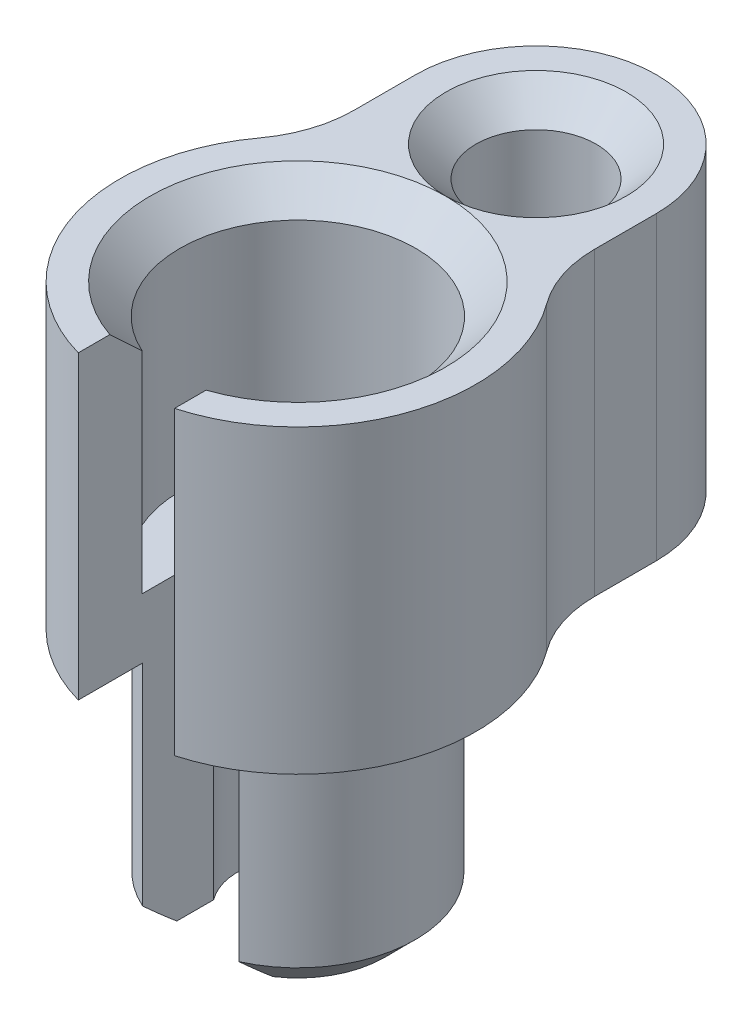
ISO-10303-21;
HEADER;
FILE_DESCRIPTION(('STEP AP214'),'2;1');
FILE_NAME('part.step','',(''),(''),'','','');
FILE_SCHEMA(('AUTOMOTIVE_DESIGN { 1 0 10303 214 1 1 1 1 }'));
ENDSEC;
DATA;
#1=APPLICATION_CONTEXT('core data for automotive mechanical design processes');
#2=APPLICATION_PROTOCOL_DEFINITION('international standard','automotive_design',2000,#1);
#3=PRODUCT_CONTEXT('',#1,'mechanical');
#4=PRODUCT('Part','Part','',(#3));
#5=PRODUCT_RELATED_PRODUCT_CATEGORY('part','',(#4));
#6=PRODUCT_DEFINITION_FORMATION('','',#4);
#7=PRODUCT_DEFINITION_CONTEXT('part definition',#1,'design');
#8=PRODUCT_DEFINITION('design','',#6,#7);
#9=PRODUCT_DEFINITION_SHAPE('','',#8);
#10=(LENGTH_UNIT() NAMED_UNIT(*) SI_UNIT(.MILLI.,.METRE.));
#11=(NAMED_UNIT(*) PLANE_ANGLE_UNIT() SI_UNIT($,.RADIAN.));
#12=(NAMED_UNIT(*) SI_UNIT($,.STERADIAN.) SOLID_ANGLE_UNIT());
#13=UNCERTAINTY_MEASURE_WITH_UNIT(LENGTH_MEASURE(1.E-05),#10,'distance_accuracy_value','');
#14=(GEOMETRIC_REPRESENTATION_CONTEXT(3) GLOBAL_UNCERTAINTY_ASSIGNED_CONTEXT((#13)) GLOBAL_UNIT_ASSIGNED_CONTEXT((#10,
#11,#12)) REPRESENTATION_CONTEXT('',''));
#15=CARTESIAN_POINT('',(0.,0.,0.));
#16=DIRECTION('',(0.,0.,1.));
#17=DIRECTION('',(1.,0.,0.));
#18=AXIS2_PLACEMENT_3D('',#15,#16,#17);
#19=CARTESIAN_POINT('',(0.,0.120875177305015,0.));
#20=DIRECTION('',(0.,1.,0.));
#21=DIRECTION('',(-1.,0.,0.));
#22=AXIS2_PLACEMENT_3D('',#19,#20,#21);
#23=CYLINDRICAL_SURFACE('',#22,4.69900000000067);
#24=CARTESIAN_POINT('',(0.,14.2875,0.));
#25=DIRECTION('',(0.,1.,0.));
#26=DIRECTION('',(-1.,0.,0.));
#27=AXIS2_PLACEMENT_3D('',#24,#25,#26);
#28=CIRCLE('',#27,4.699);
#29=CARTESIAN_POINT('',(-3.78951612903194,14.2875,-2.77851912136785));
#30=VERTEX_POINT('',#29);
#31=CARTESIAN_POINT('',(-1.27,14.2875,4.52412433516144));
#32=VERTEX_POINT('',#31);
#33=EDGE_CURVE('E362',#30,#32,#28,.T.);
#34=ORIENTED_EDGE('',*,*,#33,.F.);
#35=DIRECTION('',(0.,1.,0.));
#36=VECTOR('',#35,1.);
#37=CARTESIAN_POINT('',(-3.78951612903247,0.120875177305014,-2.77851912136825));
#38=LINE('',#37,#36);
#39=CARTESIAN_POINT('',(-3.78951612903301,6.35,-2.77851912136864));
#40=VERTEX_POINT('',#39);
#41=EDGE_CURVE('E364',#30,#40,#38,.F.);
#42=ORIENTED_EDGE('',*,*,#41,.T.);
#43=CARTESIAN_POINT('',(0.,6.35,0.));
#44=DIRECTION('',(0.,1.,0.));
#45=DIRECTION('',(-1.,0.,0.));
#46=AXIS2_PLACEMENT_3D('',#43,#44,#45);
#47=CIRCLE('',#46,4.69900000000133);
#48=CARTESIAN_POINT('',(-1.27,6.35,4.52412433516214));
#49=VERTEX_POINT('',#48);
#50=EDGE_CURVE('E430',#40,#49,#47,.T.);
#51=ORIENTED_EDGE('',*,*,#50,.T.);
#52=DIRECTION('',(0.,1.,0.));
#53=VECTOR('',#52,1.);
#54=CARTESIAN_POINT('',(-1.27,0.120875177305015,4.52412433516214));
#55=LINE('',#54,#53);
#56=EDGE_CURVE('E185',#49,#32,#55,.T.);
#57=ORIENTED_EDGE('',*,*,#56,.T.);
#58=EDGE_LOOP('',(#34,#42,#51,#57));
#59=FACE_BOUND('',#58,.T.);
#60=ADVANCED_FACE('F47',(#59),#23,.T.);
#61=CARTESIAN_POINT('',(0.,0.120875177305015,0.));
#62=DIRECTION('',(0.,1.,0.));
#63=DIRECTION('',(-1.,0.,0.));
#64=AXIS2_PLACEMENT_3D('',#61,#62,#63);
#65=CYLINDRICAL_SURFACE('',#64,3.1115);
#66=DIRECTION('',(0.,1.,0.));
#67=VECTOR('',#66,1.);
#68=CARTESIAN_POINT('',(1.27,0.120875177305015,2.84051619428582));
#69=LINE('',#68,#67);
#70=CARTESIAN_POINT('',(1.27,7.9375,2.84051619428582));
#71=VERTEX_POINT('',#70);
#72=CARTESIAN_POINT('',(1.27,13.49375,2.84051619428582));
#73=VERTEX_POINT('',#72);
#74=EDGE_CURVE('E370',#71,#73,#69,.T.);
#75=ORIENTED_EDGE('',*,*,#74,.T.);
#76=CARTESIAN_POINT('',(0.,13.49375,0.));
#77=DIRECTION('',(0.,1.,0.));
#78=DIRECTION('',(-1.,0.,0.));
#79=AXIS2_PLACEMENT_3D('',#76,#77,#78);
#80=CIRCLE('',#79,3.1115);
#81=CARTESIAN_POINT('',(-1.27,13.49375,2.84051619428582));
#82=VERTEX_POINT('',#81);
#83=EDGE_CURVE('E379',#73,#82,#80,.T.);
#84=ORIENTED_EDGE('',*,*,#83,.T.);
#85=DIRECTION('',(0.,1.,0.));
#86=VECTOR('',#85,1.);
#87=CARTESIAN_POINT('',(-1.27,0.120875177305015,2.84051619428582));
#88=LINE('',#87,#86);
#89=CARTESIAN_POINT('',(-1.27,7.9375,2.84051619428582));
#90=VERTEX_POINT('',#89);
#91=EDGE_CURVE('E461',#82,#90,#88,.F.);
#92=ORIENTED_EDGE('',*,*,#91,.T.);
#93=CARTESIAN_POINT('',(0.,7.9375,0.));
#94=DIRECTION('',(0.,1.,0.));
#95=DIRECTION('',(-1.,0.,0.));
#96=AXIS2_PLACEMENT_3D('',#93,#94,#95);
#97=CIRCLE('',#96,3.1115);
#98=EDGE_CURVE('E208',#71,#90,#97,.T.);
#99=ORIENTED_EDGE('',*,*,#98,.F.);
#100=EDGE_LOOP('',(#75,#84,#92,#99));
#101=FACE_BOUND('',#100,.T.);
#102=ADVANCED_FACE('F332',(#101),#65,.F.);
#103=CARTESIAN_POINT('',(0.,7.9375,0.));
#104=DIRECTION('',(0.,1.,0.));
#105=DIRECTION('',(-1.,0.,0.));
#106=AXIS2_PLACEMENT_3D('',#103,#104,#105);
#107=PLANE('',#106);
#108=CARTESIAN_POINT('',(0.,7.9375,0.));
#109=DIRECTION('',(0.,1.,0.));
#110=DIRECTION('',(-1.,0.,0.));
#111=AXIS2_PLACEMENT_3D('',#108,#109,#110);
#112=CIRCLE('',#111,1.5875);
#113=CARTESIAN_POINT('',(1.27,7.9375,0.952500000000001));
#114=VERTEX_POINT('',#113);
#115=CARTESIAN_POINT('',(-1.27,7.9375,0.952500000000001));
#116=VERTEX_POINT('',#115);
#117=EDGE_CURVE('E195',#114,#116,#112,.T.);
#118=ORIENTED_EDGE('',*,*,#117,.F.);
#119=DIRECTION('',(0.,0.,1.));
#120=VECTOR('',#119,1.);
#121=CARTESIAN_POINT('',(1.27,7.9375,0.));
#122=LINE('',#121,#120);
#123=EDGE_CURVE('E476',#114,#71,#122,.T.);
#124=ORIENTED_EDGE('',*,*,#123,.T.);
#125=ORIENTED_EDGE('',*,*,#98,.T.);
#126=DIRECTION('',(0.,0.,-1.));
#127=VECTOR('',#126,1.);
#128=CARTESIAN_POINT('',(-1.27,7.9375,0.));
#129=LINE('',#128,#127);
#130=EDGE_CURVE('E197',#90,#116,#129,.T.);
#131=ORIENTED_EDGE('',*,*,#130,.T.);
#132=EDGE_LOOP('',(#118,#124,#125,#131));
#133=FACE_BOUND('',#132,.T.);
#134=ADVANCED_FACE('F329',(#133),#107,.T.);
#135=CARTESIAN_POINT('',(0.,0.120875177305015,0.));
#136=DIRECTION('',(0.,1.,0.));
#137=DIRECTION('',(-1.,0.,0.));
#138=AXIS2_PLACEMENT_3D('',#135,#136,#137);
#139=CYLINDRICAL_SURFACE('',#138,1.5875);
#140=CARTESIAN_POINT('',(0.,0.,0.));
#141=DIRECTION('',(0.,1.,0.));
#142=DIRECTION('',(-1.,0.,0.));
#143=AXIS2_PLACEMENT_3D('',#140,#141,#142);
#144=CIRCLE('',#143,1.5875);
#145=CARTESIAN_POINT('',(1.27,0.,0.952500000000001));
#146=VERTEX_POINT('',#145);
#147=CARTESIAN_POINT('',(-1.27,0.,0.9525));
#148=VERTEX_POINT('',#147);
#149=EDGE_CURVE('E193',#146,#148,#144,.T.);
#150=ORIENTED_EDGE('',*,*,#149,.F.);
#151=DIRECTION('',(0.,1.,0.));
#152=VECTOR('',#151,1.);
#153=CARTESIAN_POINT('',(1.27,0.120875177305015,0.952500000000001));
#154=LINE('',#153,#152);
#155=EDGE_CURVE('E473',#146,#114,#154,.T.);
#156=ORIENTED_EDGE('',*,*,#155,.T.);
#157=ORIENTED_EDGE('',*,*,#117,.T.);
#158=DIRECTION('',(0.,1.,0.));
#159=VECTOR('',#158,1.);
#160=CARTESIAN_POINT('',(-1.27,0.120875177305015,0.952500000000001));
#161=LINE('',#160,#159);
#162=EDGE_CURVE('E178',#116,#148,#161,.F.);
#163=ORIENTED_EDGE('',*,*,#162,.T.);
#164=EDGE_LOOP('',(#150,#156,#157,#163));
#165=FACE_BOUND('',#164,.T.);
#166=ADVANCED_FACE('F191',(#165),#139,.F.);
#167=CARTESIAN_POINT('',(0.,0.,0.));
#168=DIRECTION('',(0.,-1.,0.));
#169=DIRECTION('',(1.,0.,0.));
#170=AXIS2_PLACEMENT_3D('',#167,#168,#169);
#171=PLANE('',#170);
#172=DIRECTION('',(0.,0.,-1.));
#173=VECTOR('',#172,1.);
#174=CARTESIAN_POINT('',(-1.27,0.,4.69900000000133));
#175=LINE('',#174,#173);
#176=CARTESIAN_POINT('',(-1.27,0.,1.92363081242377));
#177=VERTEX_POINT('',#176);
#178=EDGE_CURVE('E173',#177,#148,#175,.T.);
#179=ORIENTED_EDGE('',*,*,#178,.F.);
#180=CARTESIAN_POINT('',(0.,0.,0.));
#181=DIRECTION('',(0.,-1.,0.));
#182=DIRECTION('',(1.,0.,0.));
#183=AXIS2_PLACEMENT_3D('',#180,#181,#182);
#184=CIRCLE('',#183,2.30505000000133);
#185=CARTESIAN_POINT('',(1.27,0.,1.92363081242377));
#186=VERTEX_POINT('',#185);
#187=EDGE_CURVE('E297',#177,#186,#184,.T.);
#188=ORIENTED_EDGE('',*,*,#187,.T.);
#189=DIRECTION('',(0.,0.,-1.));
#190=VECTOR('',#189,1.);
#191=CARTESIAN_POINT('',(1.27,0.,4.69900000000133));
#192=LINE('',#191,#190);
#193=EDGE_CURVE('E186',#186,#146,#192,.T.);
#194=ORIENTED_EDGE('',*,*,#193,.T.);
#195=ORIENTED_EDGE('',*,*,#149,.T.);
#196=EDGE_LOOP('',(#179,#188,#194,#195));
#197=FACE_BOUND('',#196,.T.);
#198=ADVANCED_FACE('F200',(#197),#171,.T.);
#199=CARTESIAN_POINT('',(0.,0.120875177305015,0.));
#200=DIRECTION('',(0.,1.,0.));
#201=DIRECTION('',(-1.,0.,0.));
#202=AXIS2_PLACEMENT_3D('',#199,#200,#201);
#203=CYLINDRICAL_SURFACE('',#202,3.09880000000067);
#204=DIRECTION('',(0.,1.,0.));
#205=VECTOR('',#204,1.);
#206=CARTESIAN_POINT('',(1.27,0.120875177305015,2.82659891742782));
#207=LINE('',#206,#205);
#208=CARTESIAN_POINT('',(1.27,6.35,2.82659891742709));
#209=VERTEX_POINT('',#208);
#210=CARTESIAN_POINT('',(1.27,0.793749999999334,2.82659891742782));
#211=VERTEX_POINT('',#210);
#212=EDGE_CURVE('E469',#209,#211,#207,.F.);
#213=ORIENTED_EDGE('',*,*,#212,.T.);
#214=CARTESIAN_POINT('',(0.,0.793749999999334,0.));
#215=DIRECTION('',(0.,-1.,0.));
#216=DIRECTION('',(1.,0.,0.));
#217=AXIS2_PLACEMENT_3D('',#214,#215,#216);
#218=CIRCLE('',#217,3.09880000000067);
#219=CARTESIAN_POINT('',(-1.27,0.793749999999334,2.82659891742782));
#220=VERTEX_POINT('',#219);
#221=EDGE_CURVE('E251',#211,#220,#218,.F.);
#222=ORIENTED_EDGE('',*,*,#221,.T.);
#223=DIRECTION('',(0.,1.,0.));
#224=VECTOR('',#223,1.);
#225=CARTESIAN_POINT('',(-1.27,0.120875177305015,2.82659891742782));
#226=LINE('',#225,#224);
#227=CARTESIAN_POINT('',(-1.27,6.35,2.82659891742709));
#228=VERTEX_POINT('',#227);
#229=EDGE_CURVE('E198',#220,#228,#226,.T.);
#230=ORIENTED_EDGE('',*,*,#229,.T.);
#231=CARTESIAN_POINT('',(0.,6.35,0.));
#232=DIRECTION('',(0.,1.,0.));
#233=DIRECTION('',(-1.,0.,0.));
#234=AXIS2_PLACEMENT_3D('',#231,#232,#233);
#235=CIRCLE('',#234,3.0988);
#236=EDGE_CURVE('E204',#209,#228,#235,.T.);
#237=ORIENTED_EDGE('',*,*,#236,.F.);
#238=EDGE_LOOP('',(#213,#222,#230,#237));
#239=FACE_BOUND('',#238,.T.);
#240=ADVANCED_FACE('F320',(#239),#203,.T.);
#241=CARTESIAN_POINT('',(0.,6.35,0.));
#242=DIRECTION('',(0.,-1.,0.));
#243=DIRECTION('',(1.,0.,0.));
#244=AXIS2_PLACEMENT_3D('',#241,#242,#243);
#245=PLANE('',#244);
#246=CARTESIAN_POINT('',(0.,6.35,-6.28650000000066));
#247=DIRECTION('',(0.,-1.,0.));
#248=DIRECTION('',(1.,0.,0.));
#249=AXIS2_PLACEMENT_3D('',#246,#247,#248);
#250=CIRCLE('',#249,2.38125000000001);
#251=CARTESIAN_POINT('',(2.38125000000001,6.35,-6.28650000000066));
#252=VERTEX_POINT('',#251);
#253=EDGE_CURVE('E233',#252,#252,#250,.F.);
#254=ORIENTED_EDGE('',*,*,#253,.T.);
#255=EDGE_LOOP('',(#254));
#256=FACE_BOUND('',#255,.T.);
#257=CARTESIAN_POINT('',(0.,6.35,-6.28650000000066));
#258=DIRECTION('',(0.,-1.,0.));
#259=DIRECTION('',(1.,0.,0.));
#260=AXIS2_PLACEMENT_3D('',#257,#258,#259);
#261=CIRCLE('',#260,3.175);
#262=CARTESIAN_POINT('',(-3.175,6.35,-6.28650000000066));
#263=VERTEX_POINT('',#262);
#264=CARTESIAN_POINT('',(0.,6.35,-9.46150000000066));
#265=VERTEX_POINT('',#264);
#266=EDGE_CURVE('E72',#263,#265,#261,.T.);
#267=ORIENTED_EDGE('',*,*,#266,.T.);
#268=CARTESIAN_POINT('',(0.,6.35,-6.28650000000066));
#269=DIRECTION('',(0.,-1.,0.));
#270=DIRECTION('',(1.,0.,0.));
#271=AXIS2_PLACEMENT_3D('',#268,#269,#270);
#272=CIRCLE('',#271,3.175);
#273=CARTESIAN_POINT('',(3.175,6.35,-6.28650000000066));
#274=VERTEX_POINT('',#273);
#275=EDGE_CURVE('E402',#265,#274,#272,.T.);
#276=ORIENTED_EDGE('',*,*,#275,.T.);
#277=DIRECTION('',(0.,0.,-1.));
#278=VECTOR('',#277,1.);
#279=CARTESIAN_POINT('',(3.175,6.35,0.));
#280=LINE('',#279,#278);
#281=CARTESIAN_POINT('',(3.175,6.35,-4.65589690607626));
#282=VERTEX_POINT('',#281);
#283=EDGE_CURVE('E420',#282,#274,#280,.T.);
#284=ORIENTED_EDGE('',*,*,#283,.F.);
#285=CARTESIAN_POINT('',(6.35,6.35,-4.65589690607626));
#286=DIRECTION('',(0.,-1.,0.));
#287=DIRECTION('',(1.,0.,0.));
#288=AXIS2_PLACEMENT_3D('',#285,#286,#287);
#289=CIRCLE('',#288,3.175);
#290=CARTESIAN_POINT('',(3.78951612903301,6.35,-2.77851912136864));
#291=VERTEX_POINT('',#290);
#292=EDGE_CURVE('E57',#282,#291,#289,.F.);
#293=ORIENTED_EDGE('',*,*,#292,.T.);
#294=CARTESIAN_POINT('',(1.27,6.35,4.52412433516214));
#295=VERTEX_POINT('',#294);
#296=EDGE_CURVE('E211',#295,#291,#47,.T.);
#297=ORIENTED_EDGE('',*,*,#296,.F.);
#298=DIRECTION('',(0.,0.,-1.));
#299=VECTOR('',#298,1.);
#300=CARTESIAN_POINT('',(1.27,6.35,0.));
#301=LINE('',#300,#299);
#302=EDGE_CURVE('E466',#295,#209,#301,.T.);
#303=ORIENTED_EDGE('',*,*,#302,.T.);
#304=ORIENTED_EDGE('',*,*,#236,.T.);
#305=DIRECTION('',(0.,0.,1.));
#306=VECTOR('',#305,1.);
#307=CARTESIAN_POINT('',(-1.27,6.35,0.));
#308=LINE('',#307,#306);
#309=EDGE_CURVE('E453',#228,#49,#308,.T.);
#310=ORIENTED_EDGE('',*,*,#309,.T.);
#311=ORIENTED_EDGE('',*,*,#50,.F.);
#312=CARTESIAN_POINT('',(-6.35,6.35,-4.65589690607626));
#313=DIRECTION('',(0.,-1.,0.));
#314=DIRECTION('',(1.,0.,0.));
#315=AXIS2_PLACEMENT_3D('',#312,#313,#314);
#316=CIRCLE('',#315,3.175);
#317=CARTESIAN_POINT('',(-3.175,6.35,-4.65589690607626));
#318=VERTEX_POINT('',#317);
#319=EDGE_CURVE('E376',#40,#318,#316,.F.);
#320=ORIENTED_EDGE('',*,*,#319,.T.);
#321=DIRECTION('',(0.,0.,-1.));
#322=VECTOR('',#321,1.);
#323=CARTESIAN_POINT('',(-3.175,6.35,0.));
#324=LINE('',#323,#322);
#325=EDGE_CURVE('E445',#318,#263,#324,.T.);
#326=ORIENTED_EDGE('',*,*,#325,.T.);
#327=EDGE_LOOP('',(#267,#276,#284,#293,#297,#303,#304,#310,#311,#320,#326));
#328=FACE_BOUND('',#327,.T.);
#329=ADVANCED_FACE('F316',(#256,#328),#245,.T.);
#330=ORIENTED_EDGE('',*,*,#296,.T.);
#331=DIRECTION('',(0.,1.,0.));
#332=VECTOR('',#331,1.);
#333=CARTESIAN_POINT('',(3.78951612903247,0.120875177305015,-2.77851912136825));
#334=LINE('',#333,#332);
#335=CARTESIAN_POINT('',(3.78951612903193,14.2875,-2.77851912136785));
#336=VERTEX_POINT('',#335);
#337=EDGE_CURVE('E397',#291,#336,#334,.T.);
#338=ORIENTED_EDGE('',*,*,#337,.T.);
#339=CARTESIAN_POINT('',(1.27,14.2875,4.52412433516144));
#340=VERTEX_POINT('',#339);
#341=EDGE_CURVE('E369',#340,#336,#28,.T.);
#342=ORIENTED_EDGE('',*,*,#341,.F.);
#343=DIRECTION('',(0.,1.,0.));
#344=VECTOR('',#343,1.);
#345=CARTESIAN_POINT('',(1.27,0.120875177305015,4.52412433516214));
#346=LINE('',#345,#344);
#347=EDGE_CURVE('E428',#340,#295,#346,.F.);
#348=ORIENTED_EDGE('',*,*,#347,.T.);
#349=EDGE_LOOP('',(#330,#338,#342,#348));
#350=FACE_BOUND('',#349,.T.);
#351=ADVANCED_FACE('F313',(#350),#23,.T.);
#352=CARTESIAN_POINT('',(0.,14.2875,0.));
#353=DIRECTION('',(0.,1.,0.));
#354=DIRECTION('',(-1.,0.,0.));
#355=AXIS2_PLACEMENT_3D('',#352,#353,#354);
#356=PLANE('',#355);
#357=DIRECTION('',(0.,0.,1.));
#358=VECTOR('',#357,1.);
#359=CARTESIAN_POINT('',(3.175,14.2875,0.));
#360=LINE('',#359,#358);
#361=CARTESIAN_POINT('',(3.175,14.2875,-6.28650000000066));
#362=VERTEX_POINT('',#361);
#363=CARTESIAN_POINT('',(3.175,14.2875,-4.65589690607626));
#364=VERTEX_POINT('',#363);
#365=EDGE_CURVE('E434',#362,#364,#360,.T.);
#366=ORIENTED_EDGE('',*,*,#365,.F.);
#367=CARTESIAN_POINT('',(0.,14.2875,-6.28650000000066));
#368=DIRECTION('',(0.,1.,0.));
#369=DIRECTION('',(-1.,0.,0.));
#370=AXIS2_PLACEMENT_3D('',#367,#368,#369);
#371=CIRCLE('',#370,3.175);
#372=CARTESIAN_POINT('',(0.,14.2875,-9.46150000000066));
#373=VERTEX_POINT('',#372);
#374=EDGE_CURVE('E64',#362,#373,#371,.T.);
#375=ORIENTED_EDGE('',*,*,#374,.T.);
#376=CARTESIAN_POINT('',(0.,14.2875,-6.28650000000066));
#377=DIRECTION('',(0.,1.,0.));
#378=DIRECTION('',(-1.,0.,0.));
#379=AXIS2_PLACEMENT_3D('',#376,#377,#378);
#380=CIRCLE('',#379,3.175);
#381=CARTESIAN_POINT('',(-3.175,14.2875,-6.28650000000066));
#382=VERTEX_POINT('',#381);
#383=EDGE_CURVE('E405',#373,#382,#380,.T.);
#384=ORIENTED_EDGE('',*,*,#383,.T.);
#385=DIRECTION('',(0.,0.,1.));
#386=VECTOR('',#385,1.);
#387=CARTESIAN_POINT('',(-3.175,14.2875,0.));
#388=LINE('',#387,#386);
#389=CARTESIAN_POINT('',(-3.175,14.2875,-4.65589690607626));
#390=VERTEX_POINT('',#389);
#391=EDGE_CURVE('E442',#382,#390,#388,.T.);
#392=ORIENTED_EDGE('',*,*,#391,.T.);
#393=CARTESIAN_POINT('',(-6.35,14.2875,-4.65589690607626));
#394=DIRECTION('',(0.,1.,0.));
#395=DIRECTION('',(-1.,0.,0.));
#396=AXIS2_PLACEMENT_3D('',#393,#394,#395);
#397=CIRCLE('',#396,3.175);
#398=EDGE_CURVE('E375',#390,#30,#397,.F.);
#399=ORIENTED_EDGE('',*,*,#398,.T.);
#400=ORIENTED_EDGE('',*,*,#33,.T.);
#401=DIRECTION('',(0.,0.,-1.));
#402=VECTOR('',#401,1.);
#403=CARTESIAN_POINT('',(-1.27,14.2875,0.));
#404=LINE('',#403,#402);
#405=CARTESIAN_POINT('',(-1.27,14.2875,3.69297678878436));
#406=VERTEX_POINT('',#405);
#407=EDGE_CURVE('E218',#32,#406,#404,.T.);
#408=ORIENTED_EDGE('',*,*,#407,.T.);
#409=CARTESIAN_POINT('',(0.,14.2875,0.));
#410=DIRECTION('',(0.,1.,0.));
#411=DIRECTION('',(-1.,0.,0.));
#412=AXIS2_PLACEMENT_3D('',#409,#410,#411);
#413=CIRCLE('',#412,3.90525000000001);
#414=CARTESIAN_POINT('',(0.,14.2875,-3.90525000000041));
#415=VERTEX_POINT('',#414);
#416=EDGE_CURVE('E240',#406,#415,#413,.F.);
#417=ORIENTED_EDGE('',*,*,#416,.T.);
#418=CARTESIAN_POINT('',(0.,14.2875,-6.28650000000066));
#419=DIRECTION('',(0.,1.,0.));
#420=DIRECTION('',(-1.,0.,0.));
#421=AXIS2_PLACEMENT_3D('',#418,#419,#420);
#422=CIRCLE('',#421,2.38125000000001);
#423=CARTESIAN_POINT('',(-2.38125000000001,14.2875,-6.28650000000066));
#424=VERTEX_POINT('',#423);
#425=EDGE_CURVE('E244',#415,#424,#422,.F.);
#426=ORIENTED_EDGE('',*,*,#425,.T.);
#427=CARTESIAN_POINT('',(0.,14.2875,-6.28650000000066));
#428=DIRECTION('',(0.,1.,0.));
#429=DIRECTION('',(-1.,0.,0.));
#430=AXIS2_PLACEMENT_3D('',#427,#428,#429);
#431=CIRCLE('',#430,2.38125000000001);
#432=EDGE_CURVE('E247',#424,#415,#431,.F.);
#433=ORIENTED_EDGE('',*,*,#432,.T.);
#434=CARTESIAN_POINT('',(0.,14.2875,0.));
#435=DIRECTION('',(0.,1.,0.));
#436=DIRECTION('',(-1.,0.,0.));
#437=AXIS2_PLACEMENT_3D('',#434,#435,#436);
#438=CIRCLE('',#437,3.90525000000001);
#439=CARTESIAN_POINT('',(1.27,14.2875,3.69297678878436));
#440=VERTEX_POINT('',#439);
#441=EDGE_CURVE('E237',#415,#440,#438,.F.);
#442=ORIENTED_EDGE('',*,*,#441,.T.);
#443=DIRECTION('',(0.,0.,1.));
#444=VECTOR('',#443,1.);
#445=CARTESIAN_POINT('',(1.27,14.2875,0.));
#446=LINE('',#445,#444);
#447=EDGE_CURVE('E222',#440,#340,#446,.T.);
#448=ORIENTED_EDGE('',*,*,#447,.T.);
#449=ORIENTED_EDGE('',*,*,#341,.T.);
#450=CARTESIAN_POINT('',(6.35,14.2875,-4.65589690607626));
#451=DIRECTION('',(0.,1.,0.));
#452=DIRECTION('',(-1.,0.,0.));
#453=AXIS2_PLACEMENT_3D('',#450,#451,#452);
#454=CIRCLE('',#453,3.175);
#455=EDGE_CURVE('E11',#336,#364,#454,.F.);
#456=ORIENTED_EDGE('',*,*,#455,.T.);
#457=EDGE_LOOP('',(#366,#375,#384,#392,#399,#400,#408,#417,#426,#433,#442,#448,#449,#456));
#458=FACE_BOUND('',#457,.T.);
#459=ADVANCED_FACE('F309',(#458),#356,.T.);
#460=CARTESIAN_POINT('',(-1.27,0.,4.69900000000133));
#461=DIRECTION('',(1.,0.,0.));
#462=DIRECTION('',(0.,0.,-1.));
#463=AXIS2_PLACEMENT_3D('',#460,#461,#462);
#464=PLANE('',#463);
#465=ORIENTED_EDGE('',*,*,#229,.F.);
#466=CARTESIAN_POINT('',(-1.27,0.793749999999334,2.82659891742782));
#467=CARTESIAN_POINT('',(-1.27,0.726232092367753,2.75256638598474));
#468=CARTESIAN_POINT('',(-1.27,0.65894394147859,2.67832246103609));
#469=CARTESIAN_POINT('',(-1.27,0.524990491816801,2.52929071686232));
#470=CARTESIAN_POINT('',(-1.27,0.458325121976745,2.45450296147112));
#471=CARTESIAN_POINT('',(-1.27,0.325761716414736,2.30424179406362));
#472=CARTESIAN_POINT('',(-1.27,0.259863717689452,2.22876834929844));
#473=CARTESIAN_POINT('',(-1.27,0.129094107446077,2.07692313180617));
#474=CARTESIAN_POINT('',(-1.27,0.0642226163859794,2.00055125545709));
#475=CARTESIAN_POINT('',(-1.27,0.,1.92363081242377));
#476=B_SPLINE_CURVE_WITH_KNOTS('',3,(#466,#467,#468,#469,#470,#471,#472,#473,#474,#475),
.UNSPECIFIED.,.F.,.F.,(4,2,2,2,4),(0.,0.300593069160056,0.601151407123467,0.901724176173835,
1.20233195892246),.UNSPECIFIED.);
#477=EDGE_CURVE('E180',#220,#177,#476,.T.);
#478=ORIENTED_EDGE('',*,*,#477,.T.);
#479=ORIENTED_EDGE('',*,*,#178,.T.);
#480=ORIENTED_EDGE('',*,*,#162,.F.);
#481=ORIENTED_EDGE('',*,*,#130,.F.);
#482=ORIENTED_EDGE('',*,*,#91,.F.);
#483=CARTESIAN_POINT('',(-1.27,13.49375,2.84051619428582));
#484=CARTESIAN_POINT('',(-1.27,13.5591981479178,2.91220160403769));
#485=CARTESIAN_POINT('',(-1.27,13.6248644857519,2.98368709655464));
#486=CARTESIAN_POINT('',(-1.27,13.7565642887272,3.12631670133277));
#487=CARTESIAN_POINT('',(-1.27,13.8225977469199,3.19746082000811));
#488=CARTESIAN_POINT('',(-1.27,13.9549646194,3.33946840967721));
#489=CARTESIAN_POINT('',(-1.27,14.0212980319042,3.4103318823348));
#490=CARTESIAN_POINT('',(-1.27,14.1542197887815,3.55182188937238));
#491=CARTESIAN_POINT('',(-1.27,14.2208081379247,3.62244841927219));
#492=CARTESIAN_POINT('',(-1.27,14.2875,3.69297678878436));
#493=B_SPLINE_CURVE_WITH_KNOTS('',3,(#483,#484,#485,#486,#487,#488,#489,#490,#491,#492),
.UNSPECIFIED.,.F.,.F.,(4,2,2,2,4),(0.,0.29120374404004,0.582401994995177,0.873598516965686,
1.16480051427065),.UNSPECIFIED.);
#494=EDGE_CURVE('E255',#82,#406,#493,.T.);
#495=ORIENTED_EDGE('',*,*,#494,.T.);
#496=ORIENTED_EDGE('',*,*,#407,.F.);
#497=ORIENTED_EDGE('',*,*,#56,.F.);
#498=ORIENTED_EDGE('',*,*,#309,.F.);
#499=EDGE_LOOP('',(#465,#478,#479,#480,#481,#482,#495,#496,#497,#498));
#500=FACE_BOUND('',#499,.T.);
#501=ADVANCED_FACE('F176',(#500),#464,.T.);
#502=CARTESIAN_POINT('',(1.27,0.,4.69900000000133));
#503=DIRECTION('',(-1.,0.,0.));
#504=DIRECTION('',(0.,0.,1.));
#505=AXIS2_PLACEMENT_3D('',#502,#503,#504);
#506=PLANE('',#505);
#507=ORIENTED_EDGE('',*,*,#193,.F.);
#508=CARTESIAN_POINT('',(1.27,0.,1.92363081242377));
#509=CARTESIAN_POINT('',(1.27,0.0642226163859799,2.00055125545709));
#510=CARTESIAN_POINT('',(1.27,0.129094107446078,2.07692313180617));
#511=CARTESIAN_POINT('',(1.27,0.259863717689453,2.22876834929844));
#512=CARTESIAN_POINT('',(1.27,0.325761716414736,2.30424179406362));
#513=CARTESIAN_POINT('',(1.27,0.458325121976745,2.45450296147112));
#514=CARTESIAN_POINT('',(1.27,0.524990491816801,2.52929071686232));
#515=CARTESIAN_POINT('',(1.27,0.65894394147859,2.67832246103609));
#516=CARTESIAN_POINT('',(1.27,0.726232092367753,2.75256638598474));
#517=CARTESIAN_POINT('',(1.27,0.793749999999334,2.82659891742782));
#518=B_SPLINE_CURVE_WITH_KNOTS('',3,(#508,#509,#510,#511,#512,#513,#514,#515,#516,#517),
.UNSPECIFIED.,.F.,.F.,(4,2,2,2,4),(0.,0.300607782748621,0.601180551798989,0.9017388897624,
1.20233195892246),.UNSPECIFIED.);
#519=EDGE_CURVE('E296',#186,#211,#518,.T.);
#520=ORIENTED_EDGE('',*,*,#519,.T.);
#521=ORIENTED_EDGE('',*,*,#212,.F.);
#522=ORIENTED_EDGE('',*,*,#302,.F.);
#523=ORIENTED_EDGE('',*,*,#347,.F.);
#524=ORIENTED_EDGE('',*,*,#447,.F.);
#525=CARTESIAN_POINT('',(1.27,14.2875,3.69297678878436));
#526=CARTESIAN_POINT('',(1.27,14.2208081379247,3.62244841927219));
#527=CARTESIAN_POINT('',(1.27,14.1542197887815,3.55182188937238));
#528=CARTESIAN_POINT('',(1.27,14.0212980319042,3.4103318823348));
#529=CARTESIAN_POINT('',(1.27,13.9549646194,3.33946840967721));
#530=CARTESIAN_POINT('',(1.27,13.8225977469199,3.19746082000811));
#531=CARTESIAN_POINT('',(1.27,13.7565642887272,3.12631670133277));
#532=CARTESIAN_POINT('',(1.27,13.6248644857519,2.98368709655464));
#533=CARTESIAN_POINT('',(1.27,13.5591981479178,2.91220160403769));
#534=CARTESIAN_POINT('',(1.27,13.49375,2.84051619428582));
#535=B_SPLINE_CURVE_WITH_KNOTS('',3,(#525,#526,#527,#528,#529,#530,#531,#532,#533,#534),
.UNSPECIFIED.,.F.,.F.,(4,2,2,2,4),(0.,0.291201997304964,0.582398519275475,0.873596770230612,
1.16480051427065),.UNSPECIFIED.);
#536=EDGE_CURVE('E289',#440,#73,#535,.T.);
#537=ORIENTED_EDGE('',*,*,#536,.T.);
#538=ORIENTED_EDGE('',*,*,#74,.F.);
#539=ORIENTED_EDGE('',*,*,#123,.F.);
#540=ORIENTED_EDGE('',*,*,#155,.F.);
#541=EDGE_LOOP('',(#507,#520,#521,#522,#523,#524,#537,#538,#539,#540));
#542=FACE_BOUND('',#541,.T.);
#543=ADVANCED_FACE('F303',(#542),#506,.T.);
#544=CARTESIAN_POINT('',(3.175,0.,0.));
#545=DIRECTION('',(1.,0.,0.));
#546=DIRECTION('',(0.,0.,-1.));
#547=AXIS2_PLACEMENT_3D('',#544,#545,#546);
#548=PLANE('',#547);
#549=ORIENTED_EDGE('',*,*,#365,.T.);
#550=DIRECTION('',(0.,-1.,0.));
#551=VECTOR('',#550,1.);
#552=CARTESIAN_POINT('',(3.175,6.35,-4.65589690607626));
#553=LINE('',#552,#551);
#554=EDGE_CURVE('E393',#364,#282,#553,.T.);
#555=ORIENTED_EDGE('',*,*,#554,.T.);
#556=ORIENTED_EDGE('',*,*,#283,.T.);
#557=DIRECTION('',(0.,-1.,0.));
#558=VECTOR('',#557,1.);
#559=CARTESIAN_POINT('',(3.175,0.,-6.28650000000066));
#560=LINE('',#559,#558);
#561=EDGE_CURVE('E389',#274,#362,#560,.F.);
#562=ORIENTED_EDGE('',*,*,#561,.T.);
#563=EDGE_LOOP('',(#549,#555,#556,#562));
#564=FACE_BOUND('',#563,.T.);
#565=ADVANCED_FACE('F307',(#564),#548,.T.);
#566=CARTESIAN_POINT('',(-3.175,0.,0.));
#567=DIRECTION('',(1.,0.,0.));
#568=DIRECTION('',(0.,0.,-1.));
#569=AXIS2_PLACEMENT_3D('',#566,#567,#568);
#570=PLANE('',#569);
#571=ORIENTED_EDGE('',*,*,#325,.F.);
#572=DIRECTION('',(0.,1.,0.));
#573=VECTOR('',#572,1.);
#574=CARTESIAN_POINT('',(-3.175,0.,-4.65589690607626));
#575=LINE('',#574,#573);
#576=EDGE_CURVE('E383',#318,#390,#575,.T.);
#577=ORIENTED_EDGE('',*,*,#576,.T.);
#578=ORIENTED_EDGE('',*,*,#391,.F.);
#579=DIRECTION('',(0.,-1.,0.));
#580=VECTOR('',#579,1.);
#581=CARTESIAN_POINT('',(-3.175,6.35,-6.28650000000066));
#582=LINE('',#581,#580);
#583=EDGE_CURVE('E378',#382,#263,#582,.T.);
#584=ORIENTED_EDGE('',*,*,#583,.T.);
#585=EDGE_LOOP('',(#571,#577,#578,#584));
#586=FACE_BOUND('',#585,.T.);
#587=ADVANCED_FACE('F501',(#586),#570,.F.);
#588=CARTESIAN_POINT('',(0.,0.,-6.28650000000066));
#589=DIRECTION('',(0.,1.,0.));
#590=DIRECTION('',(-1.,0.,0.));
#591=AXIS2_PLACEMENT_3D('',#588,#589,#590);
#592=CYLINDRICAL_SURFACE('',#591,1.5875);
#593=CARTESIAN_POINT('',(0.,7.14375,-6.28650000000066));
#594=DIRECTION('',(0.,-1.,0.));
#595=DIRECTION('',(1.,0.,0.));
#596=AXIS2_PLACEMENT_3D('',#593,#594,#595);
#597=CIRCLE('',#596,1.5875);
#598=CARTESIAN_POINT('',(1.5875,7.14375,-6.28650000000066));
#599=VERTEX_POINT('',#598);
#600=EDGE_CURVE('E229',#599,#599,#597,.T.);
#601=ORIENTED_EDGE('',*,*,#600,.T.);
#602=EDGE_LOOP('',(#601));
#603=FACE_BOUND('',#602,.T.);
#604=CARTESIAN_POINT('',(0.,13.49375,-6.28650000000066));
#605=DIRECTION('',(0.,1.,0.));
#606=DIRECTION('',(-1.,0.,0.));
#607=AXIS2_PLACEMENT_3D('',#604,#605,#606);
#608=CIRCLE('',#607,1.5875);
#609=CARTESIAN_POINT('',(-1.5875,13.49375,-6.28650000000066));
#610=VERTEX_POINT('',#609);
#611=EDGE_CURVE('E225',#610,#610,#608,.T.);
#612=ORIENTED_EDGE('',*,*,#611,.T.);
#613=EDGE_LOOP('',(#612));
#614=FACE_BOUND('',#613,.T.);
#615=ADVANCED_FACE('F344',(#603,#614),#592,.F.);
#616=CARTESIAN_POINT('',(0.,7.14375,-6.28650000000066));
#617=DIRECTION('',(0.,-1.,0.));
#618=DIRECTION('',(1.,0.,0.));
#619=AXIS2_PLACEMENT_3D('',#616,#617,#618);
#620=CONICAL_SURFACE('',#619,1.5875,0.785398163397452);
#621=CARTESIAN_POINT('',(2.38125000000001,6.35,-6.28650000000066));
#622=CARTESIAN_POINT('',(2.37298177083334,6.35826822916667,-6.28650000000066));
#623=CARTESIAN_POINT('',(2.36471354166667,6.36653645833333,-6.28650000000066));
#624=CARTESIAN_POINT('',(2.34817708333334,6.38307291666667,-6.28650000000066));
#625=CARTESIAN_POINT('',(2.33990885416667,6.39134114583333,-6.28650000000066));
#626=CARTESIAN_POINT('',(2.32337239583334,6.40787760416667,-6.28650000000066));
#627=CARTESIAN_POINT('',(2.31510416666667,6.41614583333333,-6.28650000000066));
#628=CARTESIAN_POINT('',(2.29856770833334,6.43268229166667,-6.28650000000066));
#629=CARTESIAN_POINT('',(2.29029947916667,6.44095052083333,-6.28650000000066));
#630=CARTESIAN_POINT('',(2.27376302083334,6.45748697916667,-6.28650000000066));
#631=CARTESIAN_POINT('',(2.26549479166667,6.46575520833333,-6.28650000000066));
#632=CARTESIAN_POINT('',(2.24895833333334,6.48229166666667,-6.28650000000066));
#633=CARTESIAN_POINT('',(2.24069010416667,6.49055989583333,-6.28650000000066));
#634=CARTESIAN_POINT('',(2.22415364583334,6.50709635416667,-6.28650000000066));
#635=CARTESIAN_POINT('',(2.21588541666667,6.51536458333333,-6.28650000000066));
#636=CARTESIAN_POINT('',(2.19934895833334,6.53190104166667,-6.28650000000066));
#637=CARTESIAN_POINT('',(2.19108072916667,6.54016927083333,-6.28650000000066));
#638=CARTESIAN_POINT('',(2.17454427083334,6.55670572916667,-6.28650000000066));
#639=CARTESIAN_POINT('',(2.16627604166667,6.56497395833333,-6.28650000000066));
#640=CARTESIAN_POINT('',(2.14973958333334,6.58151041666667,-6.28650000000066));
#641=CARTESIAN_POINT('',(2.14147135416667,6.58977864583333,-6.28650000000066));
#642=CARTESIAN_POINT('',(2.12493489583334,6.60631510416667,-6.28650000000066));
#643=CARTESIAN_POINT('',(2.11666666666667,6.61458333333333,-6.28650000000066));
#644=CARTESIAN_POINT('',(2.10013020833334,6.63111979166667,-6.28650000000066));
#645=CARTESIAN_POINT('',(2.09186197916667,6.63938802083333,-6.28650000000066));
#646=CARTESIAN_POINT('',(2.07532552083334,6.65592447916667,-6.28650000000066));
#647=CARTESIAN_POINT('',(2.06705729166667,6.66419270833333,-6.28650000000066));
#648=CARTESIAN_POINT('',(2.05052083333334,6.68072916666667,-6.28650000000066));
#649=CARTESIAN_POINT('',(2.04225260416667,6.68899739583333,-6.28650000000066));
#650=CARTESIAN_POINT('',(2.02571614583334,6.70553385416667,-6.28650000000066));
#651=CARTESIAN_POINT('',(2.01744791666667,6.71380208333333,-6.28650000000066));
#652=CARTESIAN_POINT('',(2.00091145833334,6.73033854166667,-6.28650000000066));
#653=CARTESIAN_POINT('',(1.99264322916667,6.73860677083333,-6.28650000000066));
#654=CARTESIAN_POINT('',(1.97610677083334,6.75514322916667,-6.28650000000066));
#655=CARTESIAN_POINT('',(1.96783854166667,6.76341145833333,-6.28650000000066));
#656=CARTESIAN_POINT('',(1.95130208333334,6.77994791666667,-6.28650000000066));
#657=CARTESIAN_POINT('',(1.94303385416667,6.78821614583333,-6.28650000000066));
#658=CARTESIAN_POINT('',(1.92649739583334,6.80475260416667,-6.28650000000066));
#659=CARTESIAN_POINT('',(1.91822916666667,6.81302083333333,-6.28650000000066));
#660=CARTESIAN_POINT('',(1.90169270833334,6.82955729166667,-6.28650000000066));
#661=CARTESIAN_POINT('',(1.89342447916667,6.83782552083333,-6.28650000000066));
#662=CARTESIAN_POINT('',(1.87688802083333,6.85436197916667,-6.28650000000066));
#663=CARTESIAN_POINT('',(1.86861979166667,6.86263020833333,-6.28650000000066));
#664=CARTESIAN_POINT('',(1.85208333333333,6.87916666666667,-6.28650000000066));
#665=CARTESIAN_POINT('',(1.84381510416667,6.88743489583333,-6.28650000000066));
#666=CARTESIAN_POINT('',(1.82727864583333,6.90397135416667,-6.28650000000066));
#667=CARTESIAN_POINT('',(1.81901041666667,6.91223958333333,-6.28650000000066));
#668=CARTESIAN_POINT('',(1.80247395833333,6.92877604166667,-6.28650000000066));
#669=CARTESIAN_POINT('',(1.79420572916667,6.93704427083333,-6.28650000000066));
#670=CARTESIAN_POINT('',(1.77766927083333,6.95358072916667,-6.28650000000066));
#671=CARTESIAN_POINT('',(1.76940104166667,6.96184895833334,-6.28650000000066));
#672=CARTESIAN_POINT('',(1.75286458333333,6.97838541666667,-6.28650000000066));
#673=CARTESIAN_POINT('',(1.74459635416667,6.98665364583333,-6.28650000000066));
#674=CARTESIAN_POINT('',(1.72805989583333,7.00319010416667,-6.28650000000066));
#675=CARTESIAN_POINT('',(1.71979166666667,7.01145833333333,-6.28650000000066));
#676=CARTESIAN_POINT('',(1.70325520833333,7.02799479166667,-6.28650000000066));
#677=CARTESIAN_POINT('',(1.69498697916667,7.03626302083333,-6.28650000000066));
#678=CARTESIAN_POINT('',(1.67845052083333,7.05279947916667,-6.28650000000066));
#679=CARTESIAN_POINT('',(1.67018229166667,7.06106770833334,-6.28650000000066));
#680=CARTESIAN_POINT('',(1.65364583333333,7.07760416666667,-6.28650000000066));
#681=CARTESIAN_POINT('',(1.64537760416667,7.08587239583334,-6.28650000000066));
#682=CARTESIAN_POINT('',(1.62884114583333,7.10240885416667,-6.28650000000066));
#683=CARTESIAN_POINT('',(1.62057291666667,7.11067708333333,-6.28650000000066));
#684=CARTESIAN_POINT('',(1.60403645833333,7.12721354166667,-6.28650000000066));
#685=CARTESIAN_POINT('',(1.59576822916667,7.13548177083334,-6.28650000000066));
#686=CARTESIAN_POINT('',(1.5875,7.14375,-6.28650000000066));
#687=B_SPLINE_CURVE_WITH_KNOTS('',3,(#621,#622,#623,#624,#625,#626,#627,#628,#629,#630,#631,
#632,#633,#634,#635,#636,#637,#638,#639,#640,#641,#642,#643,#644,#645,#646,#647,#648,#649,#650,
#651,#652,#653,#654,#655,#656,#657,#658,#659,#660,#661,#662,#663,#664,#665,#666,#667,#668,#669,
#670,#671,#672,#673,#674,#675,#676,#677,#678,#679,#680,#681,#682,#683,#684,#685,#686),
.UNSPECIFIED.,.F.,.F.,(4,2,2,2,2,2,2,2,2,2,2,2,2,2,2,2,2,2,2,2,2,2,2,2,2,2,2,2,2,2,2,2,4),(0.,
0.0350791254729268,0.0701582509458536,0.10523737641878,0.140316501891707,0.175395627364633,
0.21047475283756,0.245553878310487,0.280633003783413,0.31571212925634,0.350791254729267,
0.385870380202194,0.42094950567512,0.456028631148047,0.491107756620973,0.5261868820939,
0.561266007566826,0.596345133039753,0.63142425851268,0.666503383985606,0.701582509458533,
0.73666163493146,0.771740760404386,0.806819885877313,0.84189901135024,0.876978136823166,
0.912057262296093,0.94713638776902,0.982215513241946,1.01729463871487,1.0523737641878,
1.08745288966073,1.12253201513365),.UNSPECIFIED.);
#688=EDGE_CURVE('BSEAM338',#252,#599,#687,.T.);
#689=ORIENTED_EDGE('',*,*,#253,.F.);
#690=ORIENTED_EDGE('',*,*,#600,.F.);
#691=ORIENTED_EDGE('',*,*,#688,.T.);
#692=ORIENTED_EDGE('',*,*,#688,.F.);
#693=EDGE_LOOP('',(#689,#691,#690,#692));
#694=FACE_BOUND('',#693,.T.);
#695=ADVANCED_FACE('F338',(#694),#620,.F.);
#696=CARTESIAN_POINT('',(0.,13.49375,-6.28650000000066));
#697=DIRECTION('',(0.,1.,0.));
#698=DIRECTION('',(-1.,0.,0.));
#699=AXIS2_PLACEMENT_3D('',#696,#697,#698);
#700=CONICAL_SURFACE('',#699,1.5875,0.785398163397452);
#701=ORIENTED_EDGE('',*,*,#425,.F.);
#702=ORIENTED_EDGE('',*,*,#432,.F.);
#703=EDGE_LOOP('',(#701,#702));
#704=FACE_BOUND('',#703,.T.);
#705=ORIENTED_EDGE('',*,*,#611,.F.);
#706=EDGE_LOOP('',(#705));
#707=FACE_BOUND('',#706,.T.);
#708=ADVANCED_FACE('F343',(#704,#707),#700,.F.);
#709=CARTESIAN_POINT('',(0.,0.793749999999334,0.));
#710=DIRECTION('',(0.,1.,0.));
#711=DIRECTION('',(-1.,0.,0.));
#712=AXIS2_PLACEMENT_3D('',#709,#710,#711);
#713=CONICAL_SURFACE('',#712,3.09880000000067,0.78539816339745);
#714=ORIENTED_EDGE('',*,*,#519,.F.);
#715=ORIENTED_EDGE('',*,*,#187,.F.);
#716=ORIENTED_EDGE('',*,*,#477,.F.);
#717=ORIENTED_EDGE('',*,*,#221,.F.);
#718=EDGE_LOOP('',(#714,#715,#716,#717));
#719=FACE_BOUND('',#718,.T.);
#720=ADVANCED_FACE('F282',(#719),#713,.T.);
#721=CARTESIAN_POINT('',(0.,13.49375,0.));
#722=DIRECTION('',(0.,1.,0.));
#723=DIRECTION('',(-1.,0.,0.));
#724=AXIS2_PLACEMENT_3D('',#721,#722,#723);
#725=CONICAL_SURFACE('',#724,3.1115,0.78539816339745);
#726=ORIENTED_EDGE('',*,*,#441,.F.);
#727=ORIENTED_EDGE('',*,*,#416,.F.);
#728=ORIENTED_EDGE('',*,*,#494,.F.);
#729=ORIENTED_EDGE('',*,*,#83,.F.);
#730=ORIENTED_EDGE('',*,*,#536,.F.);
#731=EDGE_LOOP('',(#726,#727,#728,#729,#730));
#732=FACE_BOUND('',#731,.T.);
#733=ADVANCED_FACE('F274',(#732),#725,.F.);
#734=CARTESIAN_POINT('',(-6.35,0.120875177305015,-4.65589690607626));
#735=DIRECTION('',(0.,1.,0.));
#736=DIRECTION('',(-1.,0.,0.));
#737=AXIS2_PLACEMENT_3D('',#734,#735,#736);
#738=CYLINDRICAL_SURFACE('',#737,3.175);
#739=ORIENTED_EDGE('',*,*,#398,.F.);
#740=ORIENTED_EDGE('',*,*,#576,.F.);
#741=ORIENTED_EDGE('',*,*,#319,.F.);
#742=ORIENTED_EDGE('',*,*,#41,.F.);
#743=EDGE_LOOP('',(#739,#740,#741,#742));
#744=FACE_BOUND('',#743,.T.);
#745=ADVANCED_FACE('F281',(#744),#738,.F.);
#746=CARTESIAN_POINT('',(6.35,0.120875177305015,-4.65589690607626));
#747=DIRECTION('',(0.,1.,0.));
#748=DIRECTION('',(-1.,0.,0.));
#749=AXIS2_PLACEMENT_3D('',#746,#747,#748);
#750=CYLINDRICAL_SURFACE('',#749,3.175);
#751=ORIENTED_EDGE('',*,*,#455,.F.);
#752=ORIENTED_EDGE('',*,*,#337,.F.);
#753=ORIENTED_EDGE('',*,*,#292,.F.);
#754=ORIENTED_EDGE('',*,*,#554,.F.);
#755=EDGE_LOOP('',(#751,#752,#753,#754));
#756=FACE_BOUND('',#755,.T.);
#757=ADVANCED_FACE('F432',(#756),#750,.F.);
#758=CARTESIAN_POINT('',(0.,0.,-6.28650000000066));
#759=DIRECTION('',(0.,1.,0.));
#760=DIRECTION('',(0.,0.,1.));
#761=AXIS2_PLACEMENT_3D('',#758,#759,#760);
#762=CYLINDRICAL_SURFACE('',#761,3.175);
#763=ORIENTED_EDGE('',*,*,#583,.F.);
#764=ORIENTED_EDGE('',*,*,#383,.F.);
#765=DIRECTION('',(0.,-1.,0.));
#766=VECTOR('',#765,1.);
#767=CARTESIAN_POINT('',(0.,14.2875,-9.46150000000066));
#768=LINE('',#767,#766);
#769=EDGE_CURVE('E51',#265,#373,#768,.F.);
#770=ORIENTED_EDGE('',*,*,#769,.F.);
#771=ORIENTED_EDGE('',*,*,#266,.F.);
#772=EDGE_LOOP('',(#763,#764,#770,#771));
#773=FACE_BOUND('',#772,.T.);
#774=ADVANCED_FACE('F49',(#773),#762,.T.);
#775=CARTESIAN_POINT('',(0.,0.,-6.28650000000066));
#776=DIRECTION('',(0.,-1.,0.));
#777=DIRECTION('',(0.,0.,-1.));
#778=AXIS2_PLACEMENT_3D('',#775,#776,#777);
#779=CYLINDRICAL_SURFACE('',#778,3.175);
#780=ORIENTED_EDGE('',*,*,#374,.F.);
#781=ORIENTED_EDGE('',*,*,#561,.F.);
#782=ORIENTED_EDGE('',*,*,#275,.F.);
#783=ORIENTED_EDGE('',*,*,#769,.T.);
#784=EDGE_LOOP('',(#780,#781,#782,#783));
#785=FACE_BOUND('',#784,.T.);
#786=ADVANCED_FACE('F509',(#785),#779,.T.);
#787=CLOSED_SHELL('',(#60,#102,#134,#166,#198,#240,#329,#351,#459,#501,#543,#565,#587,#615,#695,
#708,#720,#733,#745,#757,#774,#786));
#788=MANIFOLD_SOLID_BREP('B2',#787);
#789=ADVANCED_BREP_SHAPE_REPRESENTATION('',(#18,#788),#14);
#790=SHAPE_DEFINITION_REPRESENTATION(#9,#789);
ENDSEC;
END-ISO-10303-21;
